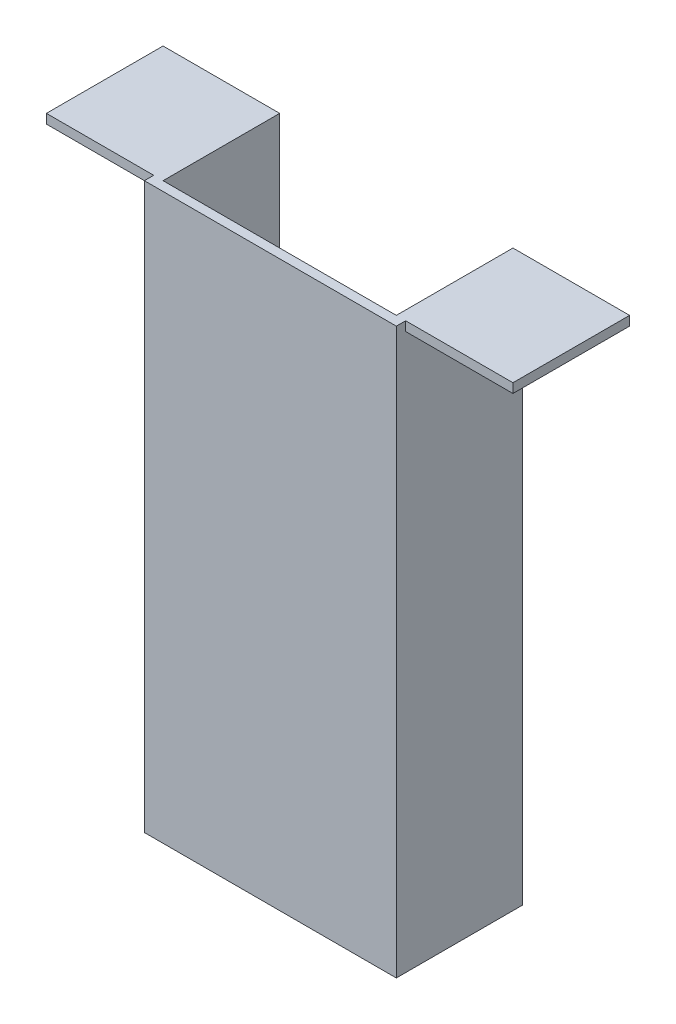
ISO-10303-21;
HEADER;
FILE_DESCRIPTION(('STEP AP214'),'2;1');
FILE_NAME('part.step','',(''),(''),'','','');
FILE_SCHEMA(('AUTOMOTIVE_DESIGN { 1 0 10303 214 1 1 1 1 }'));
ENDSEC;
DATA;
#1=APPLICATION_CONTEXT('core data for automotive mechanical design processes');
#2=APPLICATION_PROTOCOL_DEFINITION('international standard','automotive_design',2000,#1);
#3=PRODUCT_CONTEXT('',#1,'mechanical');
#4=PRODUCT('Part','Part','',(#3));
#5=PRODUCT_RELATED_PRODUCT_CATEGORY('part','',(#4));
#6=PRODUCT_DEFINITION_FORMATION('','',#4);
#7=PRODUCT_DEFINITION_CONTEXT('part definition',#1,'design');
#8=PRODUCT_DEFINITION('design','',#6,#7);
#9=PRODUCT_DEFINITION_SHAPE('','',#8);
#10=(LENGTH_UNIT() NAMED_UNIT(*) SI_UNIT(.MILLI.,.METRE.));
#11=(NAMED_UNIT(*) PLANE_ANGLE_UNIT() SI_UNIT($,.RADIAN.));
#12=(NAMED_UNIT(*) SI_UNIT($,.STERADIAN.) SOLID_ANGLE_UNIT());
#13=UNCERTAINTY_MEASURE_WITH_UNIT(LENGTH_MEASURE(1.E-05),#10,'distance_accuracy_value','');
#14=(GEOMETRIC_REPRESENTATION_CONTEXT(3) GLOBAL_UNCERTAINTY_ASSIGNED_CONTEXT((#13)) GLOBAL_UNIT_ASSIGNED_CONTEXT((#10,
#11,#12)) REPRESENTATION_CONTEXT('',''));
#15=CARTESIAN_POINT('',(0.,0.,0.));
#16=DIRECTION('',(0.,0.,1.));
#17=DIRECTION('',(1.,0.,0.));
#18=AXIS2_PLACEMENT_3D('',#15,#16,#17);
#19=CARTESIAN_POINT('',(0.,0.,25.));
#20=DIRECTION('',(0.,0.,1.));
#21=DIRECTION('',(1.,0.,0.));
#22=AXIS2_PLACEMENT_3D('',#19,#20,#21);
#23=PLANE('',#22);
#24=DIRECTION('',(0.,-1.,0.));
#25=VECTOR('',#24,1.);
#26=CARTESIAN_POINT('',(0.337959557372647,0.176185101580156,25.));
#27=LINE('',#26,#25);
#28=CARTESIAN_POINT('',(0.337959557372648,121.17618510158,25.));
#29=VERTEX_POINT('',#28);
#30=CARTESIAN_POINT('',(0.337959557372647,119.17618510158,25.));
#31=VERTEX_POINT('',#30);
#32=EDGE_CURVE('E49',#29,#31,#27,.T.);
#33=ORIENTED_EDGE('',*,*,#32,.F.);
#34=DIRECTION('',(-1.,0.,0.));
#35=VECTOR('',#34,1.);
#36=CARTESIAN_POINT('',(2.33795955737265,121.17618510158,25.));
#37=LINE('',#36,#35);
#38=CARTESIAN_POINT('',(-22.6620404426274,121.17618510158,25.));
#39=VERTEX_POINT('',#38);
#40=EDGE_CURVE('E229',#29,#39,#37,.T.);
#41=ORIENTED_EDGE('',*,*,#40,.T.);
#42=DIRECTION('',(0.,-1.,0.));
#43=VECTOR('',#42,1.);
#44=CARTESIAN_POINT('',(-22.6620404426274,121.17618510158,25.));
#45=LINE('',#44,#43);
#46=CARTESIAN_POINT('',(-22.6620404426274,119.17618510158,25.));
#47=VERTEX_POINT('',#46);
#48=EDGE_CURVE('E226',#39,#47,#45,.T.);
#49=ORIENTED_EDGE('',*,*,#48,.T.);
#50=DIRECTION('',(1.,0.,0.));
#51=VECTOR('',#50,1.);
#52=CARTESIAN_POINT('',(-22.6620404426274,119.17618510158,25.));
#53=LINE('',#52,#51);
#54=EDGE_CURVE('E228',#47,#31,#53,.T.);
#55=ORIENTED_EDGE('',*,*,#54,.T.);
#56=EDGE_LOOP('',(#33,#41,#49,#55));
#57=FACE_BOUND('',#56,.T.);
#58=ADVANCED_FACE('F33',(#57),#23,.T.);
#59=CARTESIAN_POINT('',(2.33795955737266,2.17618510158015,25.));
#60=DIRECTION('',(0.,-1.,0.));
#61=DIRECTION('',(1.,0.,0.));
#62=AXIS2_PLACEMENT_3D('',#59,#60,#61);
#63=PLANE('',#62);
#64=DIRECTION('',(-1.,0.,0.));
#65=VECTOR('',#64,1.);
#66=CARTESIAN_POINT('',(2.33795955737266,2.17618510158015,0.));
#67=LINE('',#66,#65);
#68=CARTESIAN_POINT('',(52.3379595573727,2.17618510158014,0.));
#69=VERTEX_POINT('',#68);
#70=CARTESIAN_POINT('',(2.33795955737266,2.17618510158015,0.));
#71=VERTEX_POINT('',#70);
#72=EDGE_CURVE('E165',#69,#71,#67,.T.);
#73=ORIENTED_EDGE('',*,*,#72,.T.);
#74=DIRECTION('',(0.,0.,-1.));
#75=VECTOR('',#74,1.);
#76=CARTESIAN_POINT('',(2.33795955737266,2.17618510158015,25.));
#77=LINE('',#76,#75);
#78=CARTESIAN_POINT('',(2.33795955737266,2.17618510158015,25.));
#79=VERTEX_POINT('',#78);
#80=EDGE_CURVE('E37',#79,#71,#77,.T.);
#81=ORIENTED_EDGE('',*,*,#80,.F.);
#82=DIRECTION('',(-1.,0.,0.));
#83=VECTOR('',#82,1.);
#84=CARTESIAN_POINT('',(2.33795955737266,2.17618510158015,25.));
#85=LINE('',#84,#83);
#86=CARTESIAN_POINT('',(52.3379595573727,2.17618510158014,25.));
#87=VERTEX_POINT('',#86);
#88=EDGE_CURVE('E188',#87,#79,#85,.T.);
#89=ORIENTED_EDGE('',*,*,#88,.F.);
#90=DIRECTION('',(0.,0.,-1.));
#91=VECTOR('',#90,1.);
#92=CARTESIAN_POINT('',(52.3379595573727,2.17618510158014,25.));
#93=LINE('',#92,#91);
#94=EDGE_CURVE('E58',#87,#69,#93,.T.);
#95=ORIENTED_EDGE('',*,*,#94,.T.);
#96=EDGE_LOOP('',(#73,#81,#89,#95));
#97=FACE_BOUND('',#96,.T.);
#98=ADVANCED_FACE('F35',(#97),#63,.F.);
#99=CARTESIAN_POINT('',(2.33795955737266,2.17618510158015,25.));
#100=DIRECTION('',(-1.,0.,0.));
#101=DIRECTION('',(0.,-1.,0.));
#102=AXIS2_PLACEMENT_3D('',#99,#100,#101);
#103=PLANE('',#102);
#104=DIRECTION('',(0.,1.,0.));
#105=VECTOR('',#104,1.);
#106=CARTESIAN_POINT('',(2.33795955737266,2.17618510158015,0.));
#107=LINE('',#106,#105);
#108=CARTESIAN_POINT('',(2.33795955737265,121.17618510158,0.));
#109=VERTEX_POINT('',#108);
#110=EDGE_CURVE('E168',#71,#109,#107,.T.);
#111=ORIENTED_EDGE('',*,*,#110,.T.);
#112=DIRECTION('',(0.,0.,-1.));
#113=VECTOR('',#112,1.);
#114=CARTESIAN_POINT('',(2.33795955737265,121.17618510158,25.));
#115=LINE('',#114,#113);
#116=CARTESIAN_POINT('',(2.33795955737265,121.17618510158,25.));
#117=VERTEX_POINT('',#116);
#118=EDGE_CURVE('E209',#117,#109,#115,.T.);
#119=ORIENTED_EDGE('',*,*,#118,.F.);
#120=DIRECTION('',(0.,1.,0.));
#121=VECTOR('',#120,1.);
#122=CARTESIAN_POINT('',(2.33795955737266,2.17618510158015,25.));
#123=LINE('',#122,#121);
#124=EDGE_CURVE('E110',#79,#117,#123,.T.);
#125=ORIENTED_EDGE('',*,*,#124,.F.);
#126=ORIENTED_EDGE('',*,*,#80,.T.);
#127=EDGE_LOOP('',(#111,#119,#125,#126));
#128=FACE_BOUND('',#127,.T.);
#129=ADVANCED_FACE('F213',(#128),#103,.F.);
#130=CARTESIAN_POINT('',(-22.6620404426274,121.17618510158,25.));
#131=DIRECTION('',(1.,0.,0.));
#132=DIRECTION('',(0.,0.,-1.));
#133=AXIS2_PLACEMENT_3D('',#130,#131,#132);
#134=PLANE('',#133);
#135=DIRECTION('',(0.,-1.,0.));
#136=VECTOR('',#135,1.);
#137=CARTESIAN_POINT('',(-22.6620404426274,121.17618510158,0.));
#138=LINE('',#137,#136);
#139=CARTESIAN_POINT('',(-22.6620404426274,121.17618510158,0.));
#140=VERTEX_POINT('',#139);
#141=CARTESIAN_POINT('',(-22.6620404426274,119.17618510158,0.));
#142=VERTEX_POINT('',#141);
#143=EDGE_CURVE('E172',#140,#142,#138,.T.);
#144=ORIENTED_EDGE('',*,*,#143,.T.);
#145=DIRECTION('',(0.,0.,-1.));
#146=VECTOR('',#145,1.);
#147=CARTESIAN_POINT('',(-22.6620404426274,119.17618510158,25.));
#148=LINE('',#147,#146);
#149=EDGE_CURVE('E204',#47,#142,#148,.T.);
#150=ORIENTED_EDGE('',*,*,#149,.F.);
#151=ORIENTED_EDGE('',*,*,#48,.F.);
#152=DIRECTION('',(0.,0.,-1.));
#153=VECTOR('',#152,1.);
#154=CARTESIAN_POINT('',(-22.6620404426274,121.17618510158,25.));
#155=LINE('',#154,#153);
#156=EDGE_CURVE('E207',#39,#140,#155,.T.);
#157=ORIENTED_EDGE('',*,*,#156,.T.);
#158=EDGE_LOOP('',(#144,#150,#151,#157));
#159=FACE_BOUND('',#158,.T.);
#160=ADVANCED_FACE('F224',(#159),#134,.F.);
#161=CARTESIAN_POINT('',(-22.6620404426274,119.17618510158,25.));
#162=DIRECTION('',(0.,1.,0.));
#163=DIRECTION('',(0.,0.,1.));
#164=AXIS2_PLACEMENT_3D('',#161,#162,#163);
#165=PLANE('',#164);
#166=DIRECTION('',(1.,0.,0.));
#167=VECTOR('',#166,1.);
#168=CARTESIAN_POINT('',(-22.6620404426274,119.17618510158,0.));
#169=LINE('',#168,#167);
#170=CARTESIAN_POINT('',(0.337959557372647,119.17618510158,0.));
#171=VERTEX_POINT('',#170);
#172=EDGE_CURVE('E174',#142,#171,#169,.T.);
#173=ORIENTED_EDGE('',*,*,#172,.T.);
#174=DIRECTION('',(0.,0.,-1.));
#175=VECTOR('',#174,1.);
#176=CARTESIAN_POINT('',(0.337959557372647,119.17618510158,25.));
#177=LINE('',#176,#175);
#178=EDGE_CURVE('E201',#31,#171,#177,.T.);
#179=ORIENTED_EDGE('',*,*,#178,.F.);
#180=ORIENTED_EDGE('',*,*,#54,.F.);
#181=ORIENTED_EDGE('',*,*,#149,.T.);
#182=EDGE_LOOP('',(#173,#179,#180,#181));
#183=FACE_BOUND('',#182,.T.);
#184=ADVANCED_FACE('F310',(#183),#165,.F.);
#185=CARTESIAN_POINT('',(0.337959557372647,119.17618510158,25.));
#186=DIRECTION('',(1.,0.,0.));
#187=DIRECTION('',(0.,0.,-1.));
#188=AXIS2_PLACEMENT_3D('',#185,#186,#187);
#189=PLANE('',#188);
#190=DIRECTION('',(0.,-1.,0.));
#191=VECTOR('',#190,1.);
#192=CARTESIAN_POINT('',(0.337959557372647,119.17618510158,0.));
#193=LINE('',#192,#191);
#194=CARTESIAN_POINT('',(0.337959557372647,0.176185101580156,0.));
#195=VERTEX_POINT('',#194);
#196=EDGE_CURVE('E176',#171,#195,#193,.T.);
#197=ORIENTED_EDGE('',*,*,#196,.T.);
#198=DIRECTION('',(0.,0.,-1.));
#199=VECTOR('',#198,1.);
#200=CARTESIAN_POINT('',(0.337959557372647,0.176185101580156,25.));
#201=LINE('',#200,#199);
#202=CARTESIAN_POINT('',(0.337959557372647,0.176185101580156,27.));
#203=VERTEX_POINT('',#202);
#204=EDGE_CURVE('E198',#203,#195,#201,.T.);
#205=ORIENTED_EDGE('',*,*,#204,.F.);
#206=DIRECTION('',(0.,-1.,0.));
#207=VECTOR('',#206,1.);
#208=CARTESIAN_POINT('',(0.337959557372647,0.176185101580156,27.));
#209=LINE('',#208,#207);
#210=CARTESIAN_POINT('',(0.337959557372647,121.17618510158,27.));
#211=VERTEX_POINT('',#210);
#212=EDGE_CURVE('E242',#211,#203,#209,.T.);
#213=ORIENTED_EDGE('',*,*,#212,.F.);
#214=DIRECTION('',(0.,0.,-1.));
#215=VECTOR('',#214,1.);
#216=CARTESIAN_POINT('',(0.337959557372647,121.17618510158,27.));
#217=LINE('',#216,#215);
#218=EDGE_CURVE('E237',#211,#29,#217,.T.);
#219=ORIENTED_EDGE('',*,*,#218,.T.);
#220=ORIENTED_EDGE('',*,*,#32,.T.);
#221=ORIENTED_EDGE('',*,*,#178,.T.);
#222=EDGE_LOOP('',(#197,#205,#213,#219,#220,#221));
#223=FACE_BOUND('',#222,.T.);
#224=ADVANCED_FACE('F265',(#223),#189,.F.);
#225=CARTESIAN_POINT('',(0.337959557372647,0.176185101580156,25.));
#226=DIRECTION('',(0.,1.,0.));
#227=DIRECTION('',(0.,0.,1.));
#228=AXIS2_PLACEMENT_3D('',#225,#226,#227);
#229=PLANE('',#228);
#230=DIRECTION('',(1.,0.,0.));
#231=VECTOR('',#230,1.);
#232=CARTESIAN_POINT('',(0.337959557372647,0.176185101580156,0.));
#233=LINE('',#232,#231);
#234=CARTESIAN_POINT('',(54.3379595573727,0.176185101580156,0.));
#235=VERTEX_POINT('',#234);
#236=EDGE_CURVE('E178',#195,#235,#233,.T.);
#237=ORIENTED_EDGE('',*,*,#236,.T.);
#238=DIRECTION('',(0.,0.,-1.));
#239=VECTOR('',#238,1.);
#240=CARTESIAN_POINT('',(54.3379595573727,0.176185101580156,25.));
#241=LINE('',#240,#239);
#242=CARTESIAN_POINT('',(54.3379595573727,0.176185101580156,27.));
#243=VERTEX_POINT('',#242);
#244=EDGE_CURVE('E195',#243,#235,#241,.T.);
#245=ORIENTED_EDGE('',*,*,#244,.F.);
#246=DIRECTION('',(1.,0.,0.));
#247=VECTOR('',#246,1.);
#248=CARTESIAN_POINT('',(0.337959557372647,0.176185101580156,27.));
#249=LINE('',#248,#247);
#250=EDGE_CURVE('E250',#203,#243,#249,.T.);
#251=ORIENTED_EDGE('',*,*,#250,.F.);
#252=ORIENTED_EDGE('',*,*,#204,.T.);
#253=EDGE_LOOP('',(#237,#245,#251,#252));
#254=FACE_BOUND('',#253,.T.);
#255=ADVANCED_FACE('F271',(#254),#229,.F.);
#256=CARTESIAN_POINT('',(54.3379595573727,0.176185101580156,25.));
#257=DIRECTION('',(-1.,0.,0.));
#258=DIRECTION('',(0.,-1.,0.));
#259=AXIS2_PLACEMENT_3D('',#256,#257,#258);
#260=PLANE('',#259);
#261=DIRECTION('',(0.,1.,0.));
#262=VECTOR('',#261,1.);
#263=CARTESIAN_POINT('',(54.3379595573727,0.176185101580156,0.));
#264=LINE('',#263,#262);
#265=CARTESIAN_POINT('',(54.3379595573727,119.17618510158,0.));
#266=VERTEX_POINT('',#265);
#267=EDGE_CURVE('E180',#235,#266,#264,.T.);
#268=ORIENTED_EDGE('',*,*,#267,.T.);
#269=DIRECTION('',(0.,0.,-1.));
#270=VECTOR('',#269,1.);
#271=CARTESIAN_POINT('',(54.3379595573727,119.17618510158,25.));
#272=LINE('',#271,#270);
#273=CARTESIAN_POINT('',(54.3379595573727,119.17618510158,25.));
#274=VERTEX_POINT('',#273);
#275=EDGE_CURVE('E192',#274,#266,#272,.T.);
#276=ORIENTED_EDGE('',*,*,#275,.F.);
#277=DIRECTION('',(0.,1.,0.));
#278=VECTOR('',#277,1.);
#279=CARTESIAN_POINT('',(54.3379595573727,0.176185101580156,25.));
#280=LINE('',#279,#278);
#281=CARTESIAN_POINT('',(54.3379595573727,121.17618510158,25.));
#282=VERTEX_POINT('',#281);
#283=EDGE_CURVE('E11',#274,#282,#280,.T.);
#284=ORIENTED_EDGE('',*,*,#283,.T.);
#285=DIRECTION('',(0.,0.,-1.));
#286=VECTOR('',#285,1.);
#287=CARTESIAN_POINT('',(54.3379595573727,121.17618510158,27.));
#288=LINE('',#287,#286);
#289=CARTESIAN_POINT('',(54.3379595573727,121.17618510158,27.));
#290=VERTEX_POINT('',#289);
#291=EDGE_CURVE('E158',#290,#282,#288,.T.);
#292=ORIENTED_EDGE('',*,*,#291,.F.);
#293=DIRECTION('',(0.,1.,0.));
#294=VECTOR('',#293,1.);
#295=CARTESIAN_POINT('',(54.3379595573727,0.176185101580156,27.));
#296=LINE('',#295,#294);
#297=EDGE_CURVE('E247',#243,#290,#296,.T.);
#298=ORIENTED_EDGE('',*,*,#297,.F.);
#299=ORIENTED_EDGE('',*,*,#244,.T.);
#300=EDGE_LOOP('',(#268,#276,#284,#292,#298,#299));
#301=FACE_BOUND('',#300,.T.);
#302=ADVANCED_FACE('F275',(#301),#260,.F.);
#303=CARTESIAN_POINT('',(54.3379595573727,119.17618510158,25.));
#304=DIRECTION('',(0.,1.,0.));
#305=DIRECTION('',(0.,0.,1.));
#306=AXIS2_PLACEMENT_3D('',#303,#304,#305);
#307=PLANE('',#306);
#308=DIRECTION('',(1.,0.,0.));
#309=VECTOR('',#308,1.);
#310=CARTESIAN_POINT('',(54.3379595573727,119.17618510158,0.));
#311=LINE('',#310,#309);
#312=CARTESIAN_POINT('',(77.3379595573727,119.17618510158,0.));
#313=VERTEX_POINT('',#312);
#314=EDGE_CURVE('E182',#266,#313,#311,.T.);
#315=ORIENTED_EDGE('',*,*,#314,.T.);
#316=DIRECTION('',(0.,0.,-1.));
#317=VECTOR('',#316,1.);
#318=CARTESIAN_POINT('',(77.3379595573727,119.17618510158,25.));
#319=LINE('',#318,#317);
#320=CARTESIAN_POINT('',(77.3379595573727,119.17618510158,25.));
#321=VERTEX_POINT('',#320);
#322=EDGE_CURVE('E151',#321,#313,#319,.T.);
#323=ORIENTED_EDGE('',*,*,#322,.F.);
#324=DIRECTION('',(1.,0.,0.));
#325=VECTOR('',#324,1.);
#326=CARTESIAN_POINT('',(54.3379595573727,119.17618510158,25.));
#327=LINE('',#326,#325);
#328=EDGE_CURVE('E139',#274,#321,#327,.T.);
#329=ORIENTED_EDGE('',*,*,#328,.F.);
#330=ORIENTED_EDGE('',*,*,#275,.T.);
#331=EDGE_LOOP('',(#315,#323,#329,#330));
#332=FACE_BOUND('',#331,.T.);
#333=ADVANCED_FACE('F280',(#332),#307,.F.);
#334=CARTESIAN_POINT('',(77.3379595573727,119.17618510158,25.));
#335=DIRECTION('',(-1.,0.,0.));
#336=DIRECTION('',(0.,0.,1.));
#337=AXIS2_PLACEMENT_3D('',#334,#335,#336);
#338=PLANE('',#337);
#339=DIRECTION('',(0.,1.,0.));
#340=VECTOR('',#339,1.);
#341=CARTESIAN_POINT('',(77.3379595573727,119.17618510158,0.));
#342=LINE('',#341,#340);
#343=CARTESIAN_POINT('',(77.3379595573727,121.17618510158,0.));
#344=VERTEX_POINT('',#343);
#345=EDGE_CURVE('E148',#313,#344,#342,.T.);
#346=ORIENTED_EDGE('',*,*,#345,.T.);
#347=DIRECTION('',(0.,0.,-1.));
#348=VECTOR('',#347,1.);
#349=CARTESIAN_POINT('',(77.3379595573727,121.17618510158,25.));
#350=LINE('',#349,#348);
#351=CARTESIAN_POINT('',(77.3379595573727,121.17618510158,25.));
#352=VERTEX_POINT('',#351);
#353=EDGE_CURVE('E145',#352,#344,#350,.T.);
#354=ORIENTED_EDGE('',*,*,#353,.F.);
#355=DIRECTION('',(0.,1.,0.));
#356=VECTOR('',#355,1.);
#357=CARTESIAN_POINT('',(77.3379595573727,119.17618510158,25.));
#358=LINE('',#357,#356);
#359=EDGE_CURVE('E133',#321,#352,#358,.T.);
#360=ORIENTED_EDGE('',*,*,#359,.F.);
#361=ORIENTED_EDGE('',*,*,#322,.T.);
#362=EDGE_LOOP('',(#346,#354,#360,#361));
#363=FACE_BOUND('',#362,.T.);
#364=ADVANCED_FACE('F146',(#363),#338,.F.);
#365=CARTESIAN_POINT('',(52.3379595573726,121.17618510158,25.));
#366=DIRECTION('',(0.,-1.,0.));
#367=DIRECTION('',(1.,0.,0.));
#368=AXIS2_PLACEMENT_3D('',#365,#366,#367);
#369=PLANE('',#368);
#370=DIRECTION('',(-1.,0.,0.));
#371=VECTOR('',#370,1.);
#372=CARTESIAN_POINT('',(52.3379595573726,121.17618510158,0.));
#373=LINE('',#372,#371);
#374=CARTESIAN_POINT('',(52.3379595573726,121.17618510158,0.));
#375=VERTEX_POINT('',#374);
#376=EDGE_CURVE('E185',#344,#375,#373,.T.);
#377=ORIENTED_EDGE('',*,*,#376,.T.);
#378=DIRECTION('',(0.,0.,-1.));
#379=VECTOR('',#378,1.);
#380=CARTESIAN_POINT('',(52.3379595573726,121.17618510158,25.));
#381=LINE('',#380,#379);
#382=CARTESIAN_POINT('',(52.3379595573726,121.17618510158,25.));
#383=VERTEX_POINT('',#382);
#384=EDGE_CURVE('E152',#383,#375,#381,.T.);
#385=ORIENTED_EDGE('',*,*,#384,.F.);
#386=DIRECTION('',(-1.,0.,0.));
#387=VECTOR('',#386,1.);
#388=CARTESIAN_POINT('',(0.337959557372647,121.17618510158,25.));
#389=LINE('',#388,#387);
#390=EDGE_CURVE('E241',#383,#117,#389,.T.);
#391=ORIENTED_EDGE('',*,*,#390,.T.);
#392=ORIENTED_EDGE('',*,*,#118,.T.);
#393=DIRECTION('',(-1.,0.,0.));
#394=VECTOR('',#393,1.);
#395=CARTESIAN_POINT('',(2.33795955737265,121.17618510158,0.));
#396=LINE('',#395,#394);
#397=EDGE_CURVE('E170',#109,#140,#396,.T.);
#398=ORIENTED_EDGE('',*,*,#397,.T.);
#399=ORIENTED_EDGE('',*,*,#156,.F.);
#400=ORIENTED_EDGE('',*,*,#40,.F.);
#401=ORIENTED_EDGE('',*,*,#218,.F.);
#402=DIRECTION('',(-1.,0.,0.));
#403=VECTOR('',#402,1.);
#404=CARTESIAN_POINT('',(0.337959557372647,121.17618510158,27.));
#405=LINE('',#404,#403);
#406=EDGE_CURVE('E240',#290,#211,#405,.T.);
#407=ORIENTED_EDGE('',*,*,#406,.F.);
#408=ORIENTED_EDGE('',*,*,#291,.T.);
#409=DIRECTION('',(-1.,0.,0.));
#410=VECTOR('',#409,1.);
#411=CARTESIAN_POINT('',(52.3379595573726,121.17618510158,25.));
#412=LINE('',#411,#410);
#413=EDGE_CURVE('E137',#352,#282,#412,.T.);
#414=ORIENTED_EDGE('',*,*,#413,.F.);
#415=ORIENTED_EDGE('',*,*,#353,.T.);
#416=EDGE_LOOP('',(#377,#385,#391,#392,#398,#399,#400,#401,#407,#408,#414,#415));
#417=FACE_BOUND('',#416,.T.);
#418=ADVANCED_FACE('F155',(#417),#369,.F.);
#419=CARTESIAN_POINT('',(52.3379595573727,2.17618510158014,25.));
#420=DIRECTION('',(1.,0.,0.));
#421=DIRECTION('',(0.,1.,0.));
#422=AXIS2_PLACEMENT_3D('',#419,#420,#421);
#423=PLANE('',#422);
#424=DIRECTION('',(0.,-1.,0.));
#425=VECTOR('',#424,1.);
#426=CARTESIAN_POINT('',(52.3379595573727,2.17618510158014,0.));
#427=LINE('',#426,#425);
#428=EDGE_CURVE('E102',#375,#69,#427,.T.);
#429=ORIENTED_EDGE('',*,*,#428,.T.);
#430=ORIENTED_EDGE('',*,*,#94,.F.);
#431=DIRECTION('',(0.,-1.,0.));
#432=VECTOR('',#431,1.);
#433=CARTESIAN_POINT('',(52.3379595573727,2.17618510158014,25.));
#434=LINE('',#433,#432);
#435=EDGE_CURVE('E159',#383,#87,#434,.T.);
#436=ORIENTED_EDGE('',*,*,#435,.F.);
#437=ORIENTED_EDGE('',*,*,#384,.T.);
#438=EDGE_LOOP('',(#429,#430,#436,#437));
#439=FACE_BOUND('',#438,.T.);
#440=ADVANCED_FACE('F289',(#439),#423,.F.);
#441=ORIENTED_EDGE('',*,*,#283,.F.);
#442=ORIENTED_EDGE('',*,*,#328,.T.);
#443=ORIENTED_EDGE('',*,*,#359,.T.);
#444=ORIENTED_EDGE('',*,*,#413,.T.);
#445=EDGE_LOOP('',(#441,#442,#443,#444));
#446=FACE_BOUND('',#445,.T.);
#447=ADVANCED_FACE('F135',(#446),#23,.T.);
#448=CARTESIAN_POINT('',(0.,0.,0.));
#449=DIRECTION('',(0.,0.,1.));
#450=DIRECTION('',(1.,0.,0.));
#451=AXIS2_PLACEMENT_3D('',#448,#449,#450);
#452=PLANE('',#451);
#453=ORIENTED_EDGE('',*,*,#72,.F.);
#454=ORIENTED_EDGE('',*,*,#428,.F.);
#455=ORIENTED_EDGE('',*,*,#376,.F.);
#456=ORIENTED_EDGE('',*,*,#345,.F.);
#457=ORIENTED_EDGE('',*,*,#314,.F.);
#458=ORIENTED_EDGE('',*,*,#267,.F.);
#459=ORIENTED_EDGE('',*,*,#236,.F.);
#460=ORIENTED_EDGE('',*,*,#196,.F.);
#461=ORIENTED_EDGE('',*,*,#172,.F.);
#462=ORIENTED_EDGE('',*,*,#143,.F.);
#463=ORIENTED_EDGE('',*,*,#397,.F.);
#464=ORIENTED_EDGE('',*,*,#110,.F.);
#465=EDGE_LOOP('',(#453,#454,#455,#456,#457,#458,#459,#460,#461,#462,#463,#464));
#466=FACE_BOUND('',#465,.T.);
#467=ADVANCED_FACE('F218',(#466),#452,.F.);
#468=CARTESIAN_POINT('',(0.,0.,27.));
#469=DIRECTION('',(0.,0.,-1.));
#470=DIRECTION('',(-1.,0.,0.));
#471=AXIS2_PLACEMENT_3D('',#468,#469,#470);
#472=PLANE('',#471);
#473=ORIENTED_EDGE('',*,*,#212,.T.);
#474=ORIENTED_EDGE('',*,*,#250,.T.);
#475=ORIENTED_EDGE('',*,*,#297,.T.);
#476=ORIENTED_EDGE('',*,*,#406,.T.);
#477=EDGE_LOOP('',(#473,#474,#475,#476));
#478=FACE_BOUND('',#477,.T.);
#479=ADVANCED_FACE('F257',(#478),#472,.F.);
#480=CARTESIAN_POINT('',(0.,0.,25.));
#481=DIRECTION('',(0.,0.,-1.));
#482=DIRECTION('',(-1.,0.,0.));
#483=AXIS2_PLACEMENT_3D('',#480,#481,#482);
#484=PLANE('',#483);
#485=ORIENTED_EDGE('',*,*,#88,.T.);
#486=ORIENTED_EDGE('',*,*,#124,.T.);
#487=ORIENTED_EDGE('',*,*,#390,.F.);
#488=ORIENTED_EDGE('',*,*,#435,.T.);
#489=EDGE_LOOP('',(#485,#486,#487,#488));
#490=FACE_BOUND('',#489,.T.);
#491=ADVANCED_FACE('F373',(#490),#484,.T.);
#492=CLOSED_SHELL('',(#58,#98,#129,#160,#184,#224,#255,#302,#333,#364,#418,#440,#447,#467,#479,#491));
#493=MANIFOLD_SOLID_BREP('B2',#492);
#494=ADVANCED_BREP_SHAPE_REPRESENTATION('',(#18,#493),#14);
#495=SHAPE_DEFINITION_REPRESENTATION(#9,#494);
ENDSEC;
END-ISO-10303-21;
